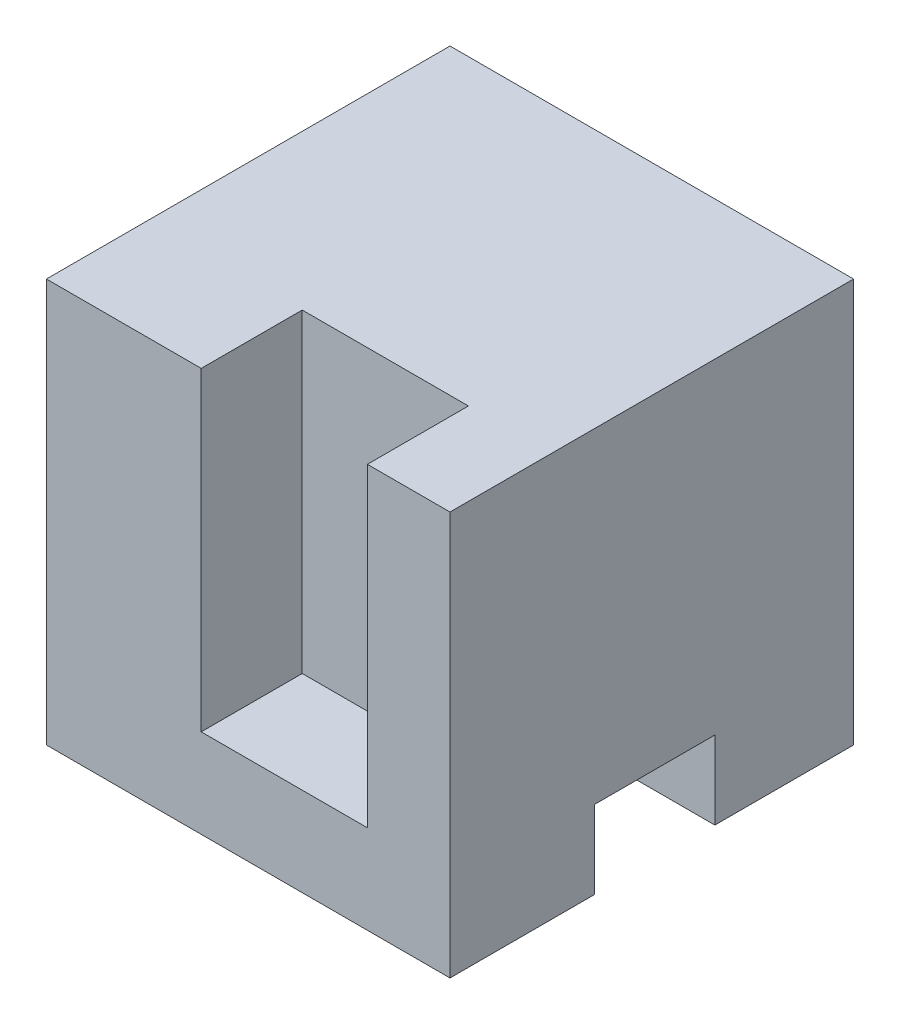
ISO-10303-21;
HEADER;
FILE_DESCRIPTION(('STEP AP214'),'2;1');
FILE_NAME('part.step','',(''),(''),'','','');
FILE_SCHEMA(('AUTOMOTIVE_DESIGN { 1 0 10303 214 1 1 1 1 }'));
ENDSEC;
DATA;
#1=APPLICATION_CONTEXT('core data for automotive mechanical design processes');
#2=APPLICATION_PROTOCOL_DEFINITION('international standard','automotive_design',2000,#1);
#3=PRODUCT_CONTEXT('',#1,'mechanical');
#4=PRODUCT('Part','Part','',(#3));
#5=PRODUCT_RELATED_PRODUCT_CATEGORY('part','',(#4));
#6=PRODUCT_DEFINITION_FORMATION('','',#4);
#7=PRODUCT_DEFINITION_CONTEXT('part definition',#1,'design');
#8=PRODUCT_DEFINITION('design','',#6,#7);
#9=PRODUCT_DEFINITION_SHAPE('','',#8);
#10=(LENGTH_UNIT() NAMED_UNIT(*) SI_UNIT(.MILLI.,.METRE.));
#11=(NAMED_UNIT(*) PLANE_ANGLE_UNIT() SI_UNIT($,.RADIAN.));
#12=(NAMED_UNIT(*) SI_UNIT($,.STERADIAN.) SOLID_ANGLE_UNIT());
#13=UNCERTAINTY_MEASURE_WITH_UNIT(LENGTH_MEASURE(1.E-05),#10,'distance_accuracy_value','');
#14=(GEOMETRIC_REPRESENTATION_CONTEXT(3) GLOBAL_UNCERTAINTY_ASSIGNED_CONTEXT((#13)) GLOBAL_UNIT_ASSIGNED_CONTEXT((#10,
#11,#12)) REPRESENTATION_CONTEXT('',''));
#15=CARTESIAN_POINT('',(0.,0.,0.));
#16=DIRECTION('',(0.,0.,1.));
#17=DIRECTION('',(1.,0.,0.));
#18=AXIS2_PLACEMENT_3D('',#15,#16,#17);
#19=CARTESIAN_POINT('',(0.,0.,25.));
#20=DIRECTION('',(1.,0.,0.));
#21=DIRECTION('',(0.,0.,-1.));
#22=AXIS2_PLACEMENT_3D('',#19,#20,#21);
#23=PLANE('',#22);
#24=DIRECTION('',(0.,-1.,0.));
#25=VECTOR('',#24,1.);
#26=CARTESIAN_POINT('',(0.,0.,-25.));
#27=LINE('',#26,#25);
#28=CARTESIAN_POINT('',(0.,50.,-25.));
#29=VERTEX_POINT('',#28);
#30=CARTESIAN_POINT('',(0.,43.5356627844499,-25.));
#31=VERTEX_POINT('',#30);
#32=EDGE_CURVE('E245',#29,#31,#27,.T.);
#33=ORIENTED_EDGE('',*,*,#32,.T.);
#34=DIRECTION('',(0.,0.,-1.));
#35=VECTOR('',#34,1.);
#36=CARTESIAN_POINT('',(0.,43.5356627844499,-25.));
#37=LINE('',#36,#35);
#38=CARTESIAN_POINT('',(0.,43.5356627844499,-8.57313265316861));
#39=VERTEX_POINT('',#38);
#40=EDGE_CURVE('E164',#39,#31,#37,.T.);
#41=ORIENTED_EDGE('',*,*,#40,.F.);
#42=DIRECTION('',(0.,1.,0.));
#43=VECTOR('',#42,1.);
#44=CARTESIAN_POINT('',(0.,43.5356627844499,-8.57313265316861));
#45=LINE('',#44,#43);
#46=CARTESIAN_POINT('',(0.,25.,-8.57313265316861));
#47=VERTEX_POINT('',#46);
#48=EDGE_CURVE('E441',#47,#39,#45,.T.);
#49=ORIENTED_EDGE('',*,*,#48,.F.);
#50=DIRECTION('',(0.,0.,1.));
#51=VECTOR('',#50,1.);
#52=CARTESIAN_POINT('',(0.,25.,-25.));
#53=LINE('',#52,#51);
#54=CARTESIAN_POINT('',(0.,25.,-25.));
#55=VERTEX_POINT('',#54);
#56=EDGE_CURVE('E442',#55,#47,#53,.T.);
#57=ORIENTED_EDGE('',*,*,#56,.F.);
#58=CARTESIAN_POINT('',(0.,0.,-25.));
#59=VERTEX_POINT('',#58);
#60=EDGE_CURVE('E169',#55,#59,#27,.T.);
#61=ORIENTED_EDGE('',*,*,#60,.T.);
#62=DIRECTION('',(0.,0.,-1.));
#63=VECTOR('',#62,1.);
#64=CARTESIAN_POINT('',(0.,0.,25.));
#65=LINE('',#64,#63);
#66=CARTESIAN_POINT('',(0.,0.,25.));
#67=VERTEX_POINT('',#66);
#68=EDGE_CURVE('E11',#67,#59,#65,.T.);
#69=ORIENTED_EDGE('',*,*,#68,.F.);
#70=DIRECTION('',(0.,-1.,0.));
#71=VECTOR('',#70,1.);
#72=CARTESIAN_POINT('',(0.,0.,25.));
#73=LINE('',#72,#71);
#74=CARTESIAN_POINT('',(0.,50.,25.));
#75=VERTEX_POINT('',#74);
#76=EDGE_CURVE('E232',#75,#67,#73,.T.);
#77=ORIENTED_EDGE('',*,*,#76,.F.);
#78=DIRECTION('',(0.,0.,-1.));
#79=VECTOR('',#78,1.);
#80=CARTESIAN_POINT('',(0.,50.,25.));
#81=LINE('',#80,#79);
#82=EDGE_CURVE('E244',#75,#29,#81,.T.);
#83=ORIENTED_EDGE('',*,*,#82,.T.);
#84=EDGE_LOOP('',(#33,#41,#49,#57,#61,#69,#77,#83));
#85=FACE_BOUND('',#84,.T.);
#86=ADVANCED_FACE('F35',(#85),#23,.F.);
#87=CARTESIAN_POINT('',(0.,0.,25.));
#88=DIRECTION('',(0.,1.,0.));
#89=DIRECTION('',(0.,0.,1.));
#90=AXIS2_PLACEMENT_3D('',#87,#88,#89);
#91=PLANE('',#90);
#92=DIRECTION('',(0.,0.,-1.));
#93=VECTOR('',#92,1.);
#94=CARTESIAN_POINT('',(11.,0.,7.07133023365714));
#95=LINE('',#94,#93);
#96=CARTESIAN_POINT('',(11.,0.,7.07133023365714));
#97=VERTEX_POINT('',#96);
#98=CARTESIAN_POINT('',(11.,0.,-7.81360231957251));
#99=VERTEX_POINT('',#98);
#100=EDGE_CURVE('E179',#97,#99,#95,.T.);
#101=ORIENTED_EDGE('',*,*,#100,.F.);
#102=DIRECTION('',(1.,0.,0.));
#103=VECTOR('',#102,1.);
#104=CARTESIAN_POINT('',(11.,0.,7.07133023365714));
#105=LINE('',#104,#103);
#106=CARTESIAN_POINT('',(50.,0.,7.07133023365714));
#107=VERTEX_POINT('',#106);
#108=EDGE_CURVE('E189',#97,#107,#105,.T.);
#109=ORIENTED_EDGE('',*,*,#108,.T.);
#110=DIRECTION('',(0.,0.,-1.));
#111=VECTOR('',#110,1.);
#112=CARTESIAN_POINT('',(50.,0.,25.));
#113=LINE('',#112,#111);
#114=CARTESIAN_POINT('',(50.,0.,25.));
#115=VERTEX_POINT('',#114);
#116=EDGE_CURVE('E42',#115,#107,#113,.T.);
#117=ORIENTED_EDGE('',*,*,#116,.F.);
#118=DIRECTION('',(1.,0.,0.));
#119=VECTOR('',#118,1.);
#120=CARTESIAN_POINT('',(0.,0.,25.));
#121=LINE('',#120,#119);
#122=EDGE_CURVE('E235',#67,#115,#121,.T.);
#123=ORIENTED_EDGE('',*,*,#122,.F.);
#124=ORIENTED_EDGE('',*,*,#68,.T.);
#125=DIRECTION('',(1.,0.,0.));
#126=VECTOR('',#125,1.);
#127=CARTESIAN_POINT('',(0.,0.,-25.));
#128=LINE('',#127,#126);
#129=CARTESIAN_POINT('',(50.,0.,-25.));
#130=VERTEX_POINT('',#129);
#131=EDGE_CURVE('E248',#59,#130,#128,.T.);
#132=ORIENTED_EDGE('',*,*,#131,.T.);
#133=CARTESIAN_POINT('',(50.,0.,-7.81360231957251));
#134=VERTEX_POINT('',#133);
#135=EDGE_CURVE('E258',#134,#130,#113,.T.);
#136=ORIENTED_EDGE('',*,*,#135,.F.);
#137=DIRECTION('',(1.,0.,0.));
#138=VECTOR('',#137,1.);
#139=CARTESIAN_POINT('',(11.,0.,-7.81360231957251));
#140=LINE('',#139,#138);
#141=EDGE_CURVE('E57',#99,#134,#140,.T.);
#142=ORIENTED_EDGE('',*,*,#141,.F.);
#143=EDGE_LOOP('',(#101,#109,#117,#123,#124,#132,#136,#142));
#144=FACE_BOUND('',#143,.T.);
#145=ADVANCED_FACE('F271',(#144),#91,.F.);
#146=CARTESIAN_POINT('',(50.,0.,25.));
#147=DIRECTION('',(-1.,0.,0.));
#148=DIRECTION('',(0.,0.,1.));
#149=AXIS2_PLACEMENT_3D('',#146,#147,#148);
#150=PLANE('',#149);
#151=ORIENTED_EDGE('',*,*,#116,.T.);
#152=DIRECTION('',(0.,-1.,0.));
#153=VECTOR('',#152,1.);
#154=CARTESIAN_POINT('',(50.,0.,7.07133023365714));
#155=LINE('',#154,#153);
#156=CARTESIAN_POINT('',(50.,9.66762334195437,7.07133023365714));
#157=VERTEX_POINT('',#156);
#158=EDGE_CURVE('E190',#157,#107,#155,.T.);
#159=ORIENTED_EDGE('',*,*,#158,.F.);
#160=DIRECTION('',(0.,0.,1.));
#161=VECTOR('',#160,1.);
#162=CARTESIAN_POINT('',(50.,9.66762334195437,7.07133023365714));
#163=LINE('',#162,#161);
#164=CARTESIAN_POINT('',(50.,9.66762334195437,-7.81360231957251));
#165=VERTEX_POINT('',#164);
#166=EDGE_CURVE('E180',#165,#157,#163,.T.);
#167=ORIENTED_EDGE('',*,*,#166,.F.);
#168=DIRECTION('',(0.,1.,0.));
#169=VECTOR('',#168,1.);
#170=CARTESIAN_POINT('',(50.,0.,-7.81360231957251));
#171=LINE('',#170,#169);
#172=EDGE_CURVE('E192',#134,#165,#171,.T.);
#173=ORIENTED_EDGE('',*,*,#172,.F.);
#174=ORIENTED_EDGE('',*,*,#135,.T.);
#175=DIRECTION('',(0.,1.,0.));
#176=VECTOR('',#175,1.);
#177=CARTESIAN_POINT('',(50.,0.,-25.));
#178=LINE('',#177,#176);
#179=CARTESIAN_POINT('',(50.,50.,-25.));
#180=VERTEX_POINT('',#179);
#181=EDGE_CURVE('E251',#130,#180,#178,.T.);
#182=ORIENTED_EDGE('',*,*,#181,.T.);
#183=DIRECTION('',(0.,0.,-1.));
#184=VECTOR('',#183,1.);
#185=CARTESIAN_POINT('',(50.,50.,25.));
#186=LINE('',#185,#184);
#187=CARTESIAN_POINT('',(50.,50.,25.));
#188=VERTEX_POINT('',#187);
#189=EDGE_CURVE('E256',#188,#180,#186,.T.);
#190=ORIENTED_EDGE('',*,*,#189,.F.);
#191=DIRECTION('',(0.,1.,0.));
#192=VECTOR('',#191,1.);
#193=CARTESIAN_POINT('',(50.,0.,25.));
#194=LINE('',#193,#192);
#195=EDGE_CURVE('E238',#115,#188,#194,.T.);
#196=ORIENTED_EDGE('',*,*,#195,.F.);
#197=EDGE_LOOP('',(#151,#159,#167,#173,#174,#182,#190,#196));
#198=FACE_BOUND('',#197,.T.);
#199=ADVANCED_FACE('F265',(#198),#150,.F.);
#200=CARTESIAN_POINT('',(0.,50.,25.));
#201=DIRECTION('',(0.,-1.,0.));
#202=DIRECTION('',(0.,0.,-1.));
#203=AXIS2_PLACEMENT_3D('',#200,#201,#202);
#204=PLANE('',#203);
#205=DIRECTION('',(-1.,0.,0.));
#206=VECTOR('',#205,1.);
#207=CARTESIAN_POINT('',(0.,50.,25.));
#208=LINE('',#207,#206);
#209=CARTESIAN_POINT('',(19.1758348486815,50.,25.));
#210=VERTEX_POINT('',#209);
#211=EDGE_CURVE('E240',#210,#75,#208,.T.);
#212=ORIENTED_EDGE('',*,*,#211,.F.);
#213=DIRECTION('',(0.,0.,1.));
#214=VECTOR('',#213,1.);
#215=CARTESIAN_POINT('',(19.1758348486815,50.,25.));
#216=LINE('',#215,#214);
#217=CARTESIAN_POINT('',(19.1758348486815,50.,12.4823263865892));
#218=VERTEX_POINT('',#217);
#219=EDGE_CURVE('E199',#218,#210,#216,.T.);
#220=ORIENTED_EDGE('',*,*,#219,.F.);
#221=DIRECTION('',(-1.,0.,0.));
#222=VECTOR('',#221,1.);
#223=CARTESIAN_POINT('',(19.1758348486815,50.,12.4823263865892));
#224=LINE('',#223,#222);
#225=CARTESIAN_POINT('',(39.7643488573181,50.,12.4823263865892));
#226=VERTEX_POINT('',#225);
#227=EDGE_CURVE('E208',#226,#218,#224,.T.);
#228=ORIENTED_EDGE('',*,*,#227,.F.);
#229=DIRECTION('',(0.,0.,-1.));
#230=VECTOR('',#229,1.);
#231=CARTESIAN_POINT('',(39.7643488573181,50.,25.));
#232=LINE('',#231,#230);
#233=CARTESIAN_POINT('',(39.7643488573181,50.,25.));
#234=VERTEX_POINT('',#233);
#235=EDGE_CURVE('E219',#234,#226,#232,.T.);
#236=ORIENTED_EDGE('',*,*,#235,.F.);
#237=EDGE_CURVE('E241',#188,#234,#208,.T.);
#238=ORIENTED_EDGE('',*,*,#237,.F.);
#239=ORIENTED_EDGE('',*,*,#189,.T.);
#240=DIRECTION('',(-1.,0.,0.));
#241=VECTOR('',#240,1.);
#242=CARTESIAN_POINT('',(0.,50.,-25.));
#243=LINE('',#242,#241);
#244=EDGE_CURVE('E236',#180,#29,#243,.T.);
#245=ORIENTED_EDGE('',*,*,#244,.T.);
#246=ORIENTED_EDGE('',*,*,#82,.F.);
#247=EDGE_LOOP('',(#212,#220,#228,#236,#238,#239,#245,#246));
#248=FACE_BOUND('',#247,.T.);
#249=ADVANCED_FACE('F278',(#248),#204,.F.);
#250=CARTESIAN_POINT('',(0.,0.,25.));
#251=DIRECTION('',(0.,0.,-1.));
#252=DIRECTION('',(-1.,0.,0.));
#253=AXIS2_PLACEMENT_3D('',#250,#251,#252);
#254=PLANE('',#253);
#255=DIRECTION('',(1.,0.,0.));
#256=VECTOR('',#255,1.);
#257=CARTESIAN_POINT('',(19.1758348486815,11.,25.));
#258=LINE('',#257,#256);
#259=CARTESIAN_POINT('',(19.1758348486815,11.,25.));
#260=VERTEX_POINT('',#259);
#261=CARTESIAN_POINT('',(39.7643488573181,11.,25.));
#262=VERTEX_POINT('',#261);
#263=EDGE_CURVE('E207',#260,#262,#258,.T.);
#264=ORIENTED_EDGE('',*,*,#263,.F.);
#265=DIRECTION('',(0.,1.,0.));
#266=VECTOR('',#265,1.);
#267=CARTESIAN_POINT('',(19.1758348486815,11.,25.));
#268=LINE('',#267,#266);
#269=EDGE_CURVE('E217',#260,#210,#268,.T.);
#270=ORIENTED_EDGE('',*,*,#269,.T.);
#271=ORIENTED_EDGE('',*,*,#211,.T.);
#272=ORIENTED_EDGE('',*,*,#76,.T.);
#273=ORIENTED_EDGE('',*,*,#122,.T.);
#274=ORIENTED_EDGE('',*,*,#195,.T.);
#275=ORIENTED_EDGE('',*,*,#237,.T.);
#276=DIRECTION('',(0.,1.,0.));
#277=VECTOR('',#276,1.);
#278=CARTESIAN_POINT('',(39.7643488573181,11.,25.));
#279=LINE('',#278,#277);
#280=EDGE_CURVE('E228',#262,#234,#279,.T.);
#281=ORIENTED_EDGE('',*,*,#280,.F.);
#282=EDGE_LOOP('',(#264,#270,#271,#272,#273,#274,#275,#281));
#283=FACE_BOUND('',#282,.T.);
#284=ADVANCED_FACE('F285',(#283),#254,.F.);
#285=CARTESIAN_POINT('',(0.,0.,-25.));
#286=DIRECTION('',(0.,0.,-1.));
#287=DIRECTION('',(-1.,0.,0.));
#288=AXIS2_PLACEMENT_3D('',#285,#286,#287);
#289=PLANE('',#288);
#290=DIRECTION('',(-1.,0.,0.));
#291=VECTOR('',#290,1.);
#292=CARTESIAN_POINT('',(39.,43.5356627844499,-25.));
#293=LINE('',#292,#291);
#294=CARTESIAN_POINT('',(39.,43.5356627844499,-25.));
#295=VERTEX_POINT('',#294);
#296=EDGE_CURVE('E193',#295,#31,#293,.T.);
#297=ORIENTED_EDGE('',*,*,#296,.T.);
#298=ORIENTED_EDGE('',*,*,#32,.F.);
#299=ORIENTED_EDGE('',*,*,#244,.F.);
#300=ORIENTED_EDGE('',*,*,#181,.F.);
#301=ORIENTED_EDGE('',*,*,#131,.F.);
#302=ORIENTED_EDGE('',*,*,#60,.F.);
#303=DIRECTION('',(-1.,0.,0.));
#304=VECTOR('',#303,1.);
#305=CARTESIAN_POINT('',(39.,25.,-25.));
#306=LINE('',#305,#304);
#307=CARTESIAN_POINT('',(39.,25.,-25.));
#308=VERTEX_POINT('',#307);
#309=EDGE_CURVE('E153',#308,#55,#306,.T.);
#310=ORIENTED_EDGE('',*,*,#309,.F.);
#311=DIRECTION('',(0.,-1.,0.));
#312=VECTOR('',#311,1.);
#313=CARTESIAN_POINT('',(39.,43.5356627844499,-25.));
#314=LINE('',#313,#312);
#315=EDGE_CURVE('E158',#295,#308,#314,.T.);
#316=ORIENTED_EDGE('',*,*,#315,.F.);
#317=EDGE_LOOP('',(#297,#298,#299,#300,#301,#302,#310,#316));
#318=FACE_BOUND('',#317,.T.);
#319=ADVANCED_FACE('F167',(#318),#289,.T.);
#320=CARTESIAN_POINT('',(19.1758348486815,11.,25.));
#321=DIRECTION('',(-1.,0.,0.));
#322=DIRECTION('',(0.,0.,1.));
#323=AXIS2_PLACEMENT_3D('',#320,#321,#322);
#324=PLANE('',#323);
#325=ORIENTED_EDGE('',*,*,#219,.T.);
#326=ORIENTED_EDGE('',*,*,#269,.F.);
#327=DIRECTION('',(0.,0.,1.));
#328=VECTOR('',#327,1.);
#329=CARTESIAN_POINT('',(19.1758348486815,11.,25.));
#330=LINE('',#329,#328);
#331=CARTESIAN_POINT('',(19.1758348486815,11.,12.4823263865892));
#332=VERTEX_POINT('',#331);
#333=EDGE_CURVE('E205',#332,#260,#330,.T.);
#334=ORIENTED_EDGE('',*,*,#333,.F.);
#335=DIRECTION('',(0.,1.,0.));
#336=VECTOR('',#335,1.);
#337=CARTESIAN_POINT('',(19.1758348486815,11.,12.4823263865892));
#338=LINE('',#337,#336);
#339=EDGE_CURVE('E224',#332,#218,#338,.T.);
#340=ORIENTED_EDGE('',*,*,#339,.T.);
#341=EDGE_LOOP('',(#325,#326,#334,#340));
#342=FACE_BOUND('',#341,.T.);
#343=ADVANCED_FACE('F291',(#342),#324,.F.);
#344=CARTESIAN_POINT('',(19.1758348486815,11.,12.4823263865892));
#345=DIRECTION('',(0.,0.,-1.));
#346=DIRECTION('',(-1.,0.,0.));
#347=AXIS2_PLACEMENT_3D('',#344,#345,#346);
#348=PLANE('',#347);
#349=ORIENTED_EDGE('',*,*,#227,.T.);
#350=ORIENTED_EDGE('',*,*,#339,.F.);
#351=DIRECTION('',(-1.,0.,0.));
#352=VECTOR('',#351,1.);
#353=CARTESIAN_POINT('',(19.1758348486815,11.,12.4823263865892));
#354=LINE('',#353,#352);
#355=CARTESIAN_POINT('',(39.7643488573181,11.,12.4823263865892));
#356=VERTEX_POINT('',#355);
#357=EDGE_CURVE('E214',#356,#332,#354,.T.);
#358=ORIENTED_EDGE('',*,*,#357,.F.);
#359=DIRECTION('',(0.,1.,0.));
#360=VECTOR('',#359,1.);
#361=CARTESIAN_POINT('',(39.7643488573181,11.,12.4823263865892));
#362=LINE('',#361,#360);
#363=EDGE_CURVE('E226',#356,#226,#362,.T.);
#364=ORIENTED_EDGE('',*,*,#363,.T.);
#365=EDGE_LOOP('',(#349,#350,#358,#364));
#366=FACE_BOUND('',#365,.T.);
#367=ADVANCED_FACE('F295',(#366),#348,.F.);
#368=CARTESIAN_POINT('',(39.7643488573181,11.,25.));
#369=DIRECTION('',(1.,0.,0.));
#370=DIRECTION('',(0.,0.,-1.));
#371=AXIS2_PLACEMENT_3D('',#368,#369,#370);
#372=PLANE('',#371);
#373=ORIENTED_EDGE('',*,*,#235,.T.);
#374=ORIENTED_EDGE('',*,*,#363,.F.);
#375=DIRECTION('',(0.,0.,-1.));
#376=VECTOR('',#375,1.);
#377=CARTESIAN_POINT('',(39.7643488573181,11.,25.));
#378=LINE('',#377,#376);
#379=EDGE_CURVE('E211',#262,#356,#378,.T.);
#380=ORIENTED_EDGE('',*,*,#379,.F.);
#381=ORIENTED_EDGE('',*,*,#280,.T.);
#382=EDGE_LOOP('',(#373,#374,#380,#381));
#383=FACE_BOUND('',#382,.T.);
#384=ADVANCED_FACE('F297',(#383),#372,.F.);
#385=CARTESIAN_POINT('',(0.,11.,0.));
#386=DIRECTION('',(0.,-1.,0.));
#387=DIRECTION('',(0.,0.,-1.));
#388=AXIS2_PLACEMENT_3D('',#385,#386,#387);
#389=PLANE('',#388);
#390=ORIENTED_EDGE('',*,*,#333,.T.);
#391=ORIENTED_EDGE('',*,*,#263,.T.);
#392=ORIENTED_EDGE('',*,*,#379,.T.);
#393=ORIENTED_EDGE('',*,*,#357,.T.);
#394=EDGE_LOOP('',(#390,#391,#392,#393));
#395=FACE_BOUND('',#394,.T.);
#396=ADVANCED_FACE('F300',(#395),#389,.F.);
#397=CARTESIAN_POINT('',(11.,0.,7.07133023365714));
#398=DIRECTION('',(0.,0.,1.));
#399=DIRECTION('',(1.,0.,0.));
#400=AXIS2_PLACEMENT_3D('',#397,#398,#399);
#401=PLANE('',#400);
#402=ORIENTED_EDGE('',*,*,#158,.T.);
#403=ORIENTED_EDGE('',*,*,#108,.F.);
#404=DIRECTION('',(0.,-1.,0.));
#405=VECTOR('',#404,1.);
#406=CARTESIAN_POINT('',(11.,0.,7.07133023365714));
#407=LINE('',#406,#405);
#408=CARTESIAN_POINT('',(11.,9.66762334195437,7.07133023365714));
#409=VERTEX_POINT('',#408);
#410=EDGE_CURVE('E176',#409,#97,#407,.T.);
#411=ORIENTED_EDGE('',*,*,#410,.F.);
#412=DIRECTION('',(1.,0.,0.));
#413=VECTOR('',#412,1.);
#414=CARTESIAN_POINT('',(11.,9.66762334195437,7.07133023365714));
#415=LINE('',#414,#413);
#416=EDGE_CURVE('E197',#409,#157,#415,.T.);
#417=ORIENTED_EDGE('',*,*,#416,.T.);
#418=EDGE_LOOP('',(#402,#403,#411,#417));
#419=FACE_BOUND('',#418,.T.);
#420=ADVANCED_FACE('F302',(#419),#401,.F.);
#421=CARTESIAN_POINT('',(11.,9.66762334195437,7.07133023365714));
#422=DIRECTION('',(0.,1.,0.));
#423=DIRECTION('',(0.,0.,1.));
#424=AXIS2_PLACEMENT_3D('',#421,#422,#423);
#425=PLANE('',#424);
#426=ORIENTED_EDGE('',*,*,#166,.T.);
#427=ORIENTED_EDGE('',*,*,#416,.F.);
#428=DIRECTION('',(0.,0.,1.));
#429=VECTOR('',#428,1.);
#430=CARTESIAN_POINT('',(11.,9.66762334195437,7.07133023365714));
#431=LINE('',#430,#429);
#432=CARTESIAN_POINT('',(11.,9.66762334195437,-7.81360231957251));
#433=VERTEX_POINT('',#432);
#434=EDGE_CURVE('E186',#433,#409,#431,.T.);
#435=ORIENTED_EDGE('',*,*,#434,.F.);
#436=DIRECTION('',(1.,0.,0.));
#437=VECTOR('',#436,1.);
#438=CARTESIAN_POINT('',(11.,9.66762334195437,-7.81360231957251));
#439=LINE('',#438,#437);
#440=EDGE_CURVE('E200',#433,#165,#439,.T.);
#441=ORIENTED_EDGE('',*,*,#440,.T.);
#442=EDGE_LOOP('',(#426,#427,#435,#441));
#443=FACE_BOUND('',#442,.T.);
#444=ADVANCED_FACE('F308',(#443),#425,.F.);
#445=CARTESIAN_POINT('',(11.,0.,-7.81360231957251));
#446=DIRECTION('',(0.,0.,-1.));
#447=DIRECTION('',(-1.,0.,0.));
#448=AXIS2_PLACEMENT_3D('',#445,#446,#447);
#449=PLANE('',#448);
#450=ORIENTED_EDGE('',*,*,#172,.T.);
#451=ORIENTED_EDGE('',*,*,#440,.F.);
#452=DIRECTION('',(0.,1.,0.));
#453=VECTOR('',#452,1.);
#454=CARTESIAN_POINT('',(11.,0.,-7.81360231957251));
#455=LINE('',#454,#453);
#456=EDGE_CURVE('E183',#99,#433,#455,.T.);
#457=ORIENTED_EDGE('',*,*,#456,.F.);
#458=ORIENTED_EDGE('',*,*,#141,.T.);
#459=EDGE_LOOP('',(#450,#451,#457,#458));
#460=FACE_BOUND('',#459,.T.);
#461=ADVANCED_FACE('F369',(#460),#449,.F.);
#462=CARTESIAN_POINT('',(11.,0.,0.));
#463=DIRECTION('',(-1.,0.,0.));
#464=DIRECTION('',(0.,0.,1.));
#465=AXIS2_PLACEMENT_3D('',#462,#463,#464);
#466=PLANE('',#465);
#467=ORIENTED_EDGE('',*,*,#410,.T.);
#468=ORIENTED_EDGE('',*,*,#100,.T.);
#469=ORIENTED_EDGE('',*,*,#456,.T.);
#470=ORIENTED_EDGE('',*,*,#434,.T.);
#471=EDGE_LOOP('',(#467,#468,#469,#470));
#472=FACE_BOUND('',#471,.T.);
#473=ADVANCED_FACE('F379',(#472),#466,.F.);
#474=CARTESIAN_POINT('',(39.,43.5356627844499,-25.));
#475=DIRECTION('',(0.,1.,0.));
#476=DIRECTION('',(0.,0.,1.));
#477=AXIS2_PLACEMENT_3D('',#474,#475,#476);
#478=PLANE('',#477);
#479=ORIENTED_EDGE('',*,*,#40,.T.);
#480=ORIENTED_EDGE('',*,*,#296,.F.);
#481=DIRECTION('',(0.,0.,-1.));
#482=VECTOR('',#481,1.);
#483=CARTESIAN_POINT('',(39.,43.5356627844499,-25.));
#484=LINE('',#483,#482);
#485=CARTESIAN_POINT('',(39.,43.5356627844499,-8.57313265316861));
#486=VERTEX_POINT('',#485);
#487=EDGE_CURVE('E49',#486,#295,#484,.T.);
#488=ORIENTED_EDGE('',*,*,#487,.F.);
#489=DIRECTION('',(-1.,0.,0.));
#490=VECTOR('',#489,1.);
#491=CARTESIAN_POINT('',(39.,43.5356627844499,-8.57313265316861));
#492=LINE('',#491,#490);
#493=EDGE_CURVE('E171',#486,#39,#492,.T.);
#494=ORIENTED_EDGE('',*,*,#493,.T.);
#495=EDGE_LOOP('',(#479,#480,#488,#494));
#496=FACE_BOUND('',#495,.T.);
#497=ADVANCED_FACE('F387',(#496),#478,.F.);
#498=CARTESIAN_POINT('',(39.,43.5356627844499,-8.57313265316861));
#499=DIRECTION('',(0.,0.,1.));
#500=DIRECTION('',(1.,0.,0.));
#501=AXIS2_PLACEMENT_3D('',#498,#499,#500);
#502=PLANE('',#501);
#503=ORIENTED_EDGE('',*,*,#48,.T.);
#504=ORIENTED_EDGE('',*,*,#493,.F.);
#505=DIRECTION('',(0.,1.,0.));
#506=VECTOR('',#505,1.);
#507=CARTESIAN_POINT('',(39.,43.5356627844499,-8.57313265316861));
#508=LINE('',#507,#506);
#509=CARTESIAN_POINT('',(39.,25.,-8.57313265316861));
#510=VERTEX_POINT('',#509);
#511=EDGE_CURVE('E157',#510,#486,#508,.T.);
#512=ORIENTED_EDGE('',*,*,#511,.F.);
#513=DIRECTION('',(-1.,0.,0.));
#514=VECTOR('',#513,1.);
#515=CARTESIAN_POINT('',(39.,25.,-8.57313265316861));
#516=LINE('',#515,#514);
#517=EDGE_CURVE('E155',#510,#47,#516,.T.);
#518=ORIENTED_EDGE('',*,*,#517,.T.);
#519=EDGE_LOOP('',(#503,#504,#512,#518));
#520=FACE_BOUND('',#519,.T.);
#521=ADVANCED_FACE('F409',(#520),#502,.F.);
#522=CARTESIAN_POINT('',(39.,25.,-25.));
#523=DIRECTION('',(0.,-1.,0.));
#524=DIRECTION('',(0.,0.,-1.));
#525=AXIS2_PLACEMENT_3D('',#522,#523,#524);
#526=PLANE('',#525);
#527=ORIENTED_EDGE('',*,*,#56,.T.);
#528=ORIENTED_EDGE('',*,*,#517,.F.);
#529=DIRECTION('',(0.,0.,1.));
#530=VECTOR('',#529,1.);
#531=CARTESIAN_POINT('',(39.,25.,-25.));
#532=LINE('',#531,#530);
#533=EDGE_CURVE('E149',#308,#510,#532,.T.);
#534=ORIENTED_EDGE('',*,*,#533,.F.);
#535=ORIENTED_EDGE('',*,*,#309,.T.);
#536=EDGE_LOOP('',(#527,#528,#534,#535));
#537=FACE_BOUND('',#536,.T.);
#538=ADVANCED_FACE('F151',(#537),#526,.F.);
#539=CARTESIAN_POINT('',(39.,0.,0.));
#540=DIRECTION('',(-1.,0.,0.));
#541=DIRECTION('',(0.,0.,1.));
#542=AXIS2_PLACEMENT_3D('',#539,#540,#541);
#543=PLANE('',#542);
#544=ORIENTED_EDGE('',*,*,#315,.T.);
#545=ORIENTED_EDGE('',*,*,#533,.T.);
#546=ORIENTED_EDGE('',*,*,#511,.T.);
#547=ORIENTED_EDGE('',*,*,#487,.T.);
#548=EDGE_LOOP('',(#544,#545,#546,#547));
#549=FACE_BOUND('',#548,.T.);
#550=ADVANCED_FACE('F161',(#549),#543,.T.);
#551=CLOSED_SHELL('',(#86,#145,#199,#249,#284,#319,#343,#367,#384,#396,#420,#444,#461,#473,#497,
#521,#538,#550));
#552=MANIFOLD_SOLID_BREP('B2',#551);
#553=ADVANCED_BREP_SHAPE_REPRESENTATION('',(#18,#552),#14);
#554=SHAPE_DEFINITION_REPRESENTATION(#9,#553);
ENDSEC;
END-ISO-10303-21;
